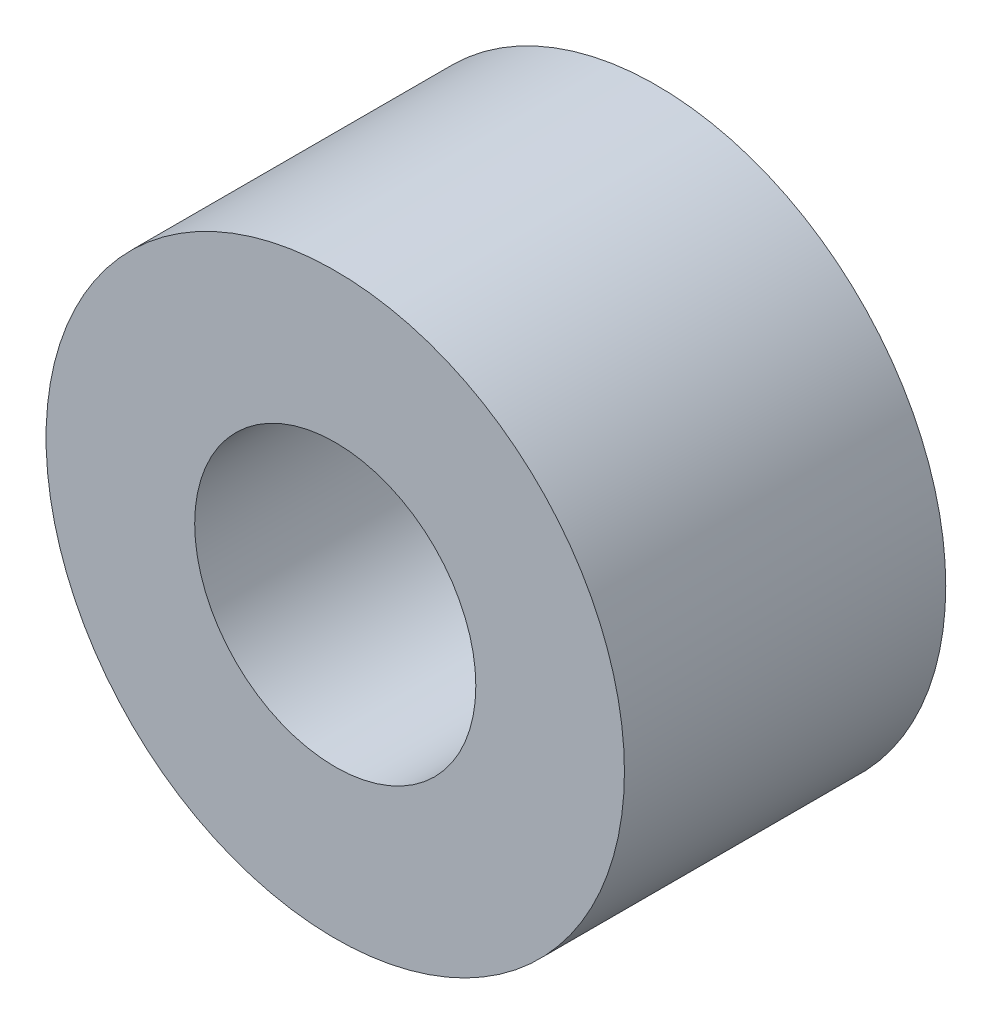
ISO-10303-21;
HEADER;
FILE_DESCRIPTION(('STEP AP214'),'2;1');
FILE_NAME('part.step','',(''),(''),'','','');
FILE_SCHEMA(('AUTOMOTIVE_DESIGN { 1 0 10303 214 1 1 1 1 }'));
ENDSEC;
DATA;
#1=APPLICATION_CONTEXT('core data for automotive mechanical design processes');
#2=APPLICATION_PROTOCOL_DEFINITION('international standard','automotive_design',2000,#1);
#3=PRODUCT_CONTEXT('',#1,'mechanical');
#4=PRODUCT('Part','Part','',(#3));
#5=PRODUCT_RELATED_PRODUCT_CATEGORY('part','',(#4));
#6=PRODUCT_DEFINITION_FORMATION('','',#4);
#7=PRODUCT_DEFINITION_CONTEXT('part definition',#1,'design');
#8=PRODUCT_DEFINITION('design','',#6,#7);
#9=PRODUCT_DEFINITION_SHAPE('','',#8);
#10=(LENGTH_UNIT() NAMED_UNIT(*) SI_UNIT(.MILLI.,.METRE.));
#11=(NAMED_UNIT(*) PLANE_ANGLE_UNIT() SI_UNIT($,.RADIAN.));
#12=(NAMED_UNIT(*) SI_UNIT($,.STERADIAN.) SOLID_ANGLE_UNIT());
#13=UNCERTAINTY_MEASURE_WITH_UNIT(LENGTH_MEASURE(1.E-05),#10,'distance_accuracy_value','');
#14=(GEOMETRIC_REPRESENTATION_CONTEXT(3) GLOBAL_UNCERTAINTY_ASSIGNED_CONTEXT((#13)) GLOBAL_UNIT_ASSIGNED_CONTEXT((#10,
#11,#12)) REPRESENTATION_CONTEXT('',''));
#15=CARTESIAN_POINT('',(0.,0.,0.));
#16=DIRECTION('',(0.,0.,1.));
#17=DIRECTION('',(1.,0.,0.));
#18=AXIS2_PLACEMENT_3D('',#15,#16,#17);
#19=CARTESIAN_POINT('',(0.,0.,20.));
#20=DIRECTION('',(0.,0.,-1.));
#21=DIRECTION('',(-1.,0.,0.));
#22=AXIS2_PLACEMENT_3D('',#19,#20,#21);
#23=CYLINDRICAL_SURFACE('',#22,18.);
#24=CARTESIAN_POINT('',(0.,0.,20.));
#25=DIRECTION('',(0.,0.,1.));
#26=DIRECTION('',(1.,0.,0.));
#27=AXIS2_PLACEMENT_3D('',#24,#25,#26);
#28=CIRCLE('',#27,18.);
#29=CARTESIAN_POINT('',(18.,0.,20.));
#30=VERTEX_POINT('',#29);
#31=EDGE_CURVE('E10',#30,#30,#28,.T.);
#32=ORIENTED_EDGE('',*,*,#31,.F.);
#33=EDGE_LOOP('',(#32));
#34=FACE_BOUND('',#33,.T.);
#35=CARTESIAN_POINT('',(0.,0.,0.));
#36=DIRECTION('',(0.,0.,1.));
#37=DIRECTION('',(1.,0.,0.));
#38=AXIS2_PLACEMENT_3D('',#35,#36,#37);
#39=CIRCLE('',#38,18.);
#40=CARTESIAN_POINT('',(18.,0.,0.));
#41=VERTEX_POINT('',#40);
#42=EDGE_CURVE('E39',#41,#41,#39,.T.);
#43=ORIENTED_EDGE('',*,*,#42,.T.);
#44=EDGE_LOOP('',(#43));
#45=FACE_BOUND('',#44,.T.);
#46=ADVANCED_FACE('F36',(#34,#45),#23,.T.);
#47=CARTESIAN_POINT('',(0.,0.,20.));
#48=DIRECTION('',(0.,0.,1.));
#49=DIRECTION('',(1.,0.,0.));
#50=AXIS2_PLACEMENT_3D('',#47,#48,#49);
#51=PLANE('',#50);
#52=CARTESIAN_POINT('',(0.,0.,20.));
#53=DIRECTION('',(0.,0.,1.));
#54=DIRECTION('',(1.,0.,0.));
#55=AXIS2_PLACEMENT_3D('',#52,#53,#54);
#56=CIRCLE('',#55,8.74999999999999);
#57=CARTESIAN_POINT('',(8.74999999999999,0.,20.));
#58=VERTEX_POINT('',#57);
#59=EDGE_CURVE('E46',#58,#58,#56,.T.);
#60=ORIENTED_EDGE('',*,*,#59,.F.);
#61=EDGE_LOOP('',(#60));
#62=FACE_BOUND('',#61,.T.);
#63=ORIENTED_EDGE('',*,*,#31,.T.);
#64=EDGE_LOOP('',(#63));
#65=FACE_BOUND('',#64,.T.);
#66=ADVANCED_FACE('F59',(#62,#65),#51,.T.);
#67=CARTESIAN_POINT('',(0.,0.,0.));
#68=DIRECTION('',(0.,0.,1.));
#69=DIRECTION('',(1.,0.,0.));
#70=AXIS2_PLACEMENT_3D('',#67,#68,#69);
#71=PLANE('',#70);
#72=CARTESIAN_POINT('',(0.,0.,0.));
#73=DIRECTION('',(0.,0.,-1.));
#74=DIRECTION('',(-1.,0.,0.));
#75=AXIS2_PLACEMENT_3D('',#72,#73,#74);
#76=CIRCLE('',#75,8.75);
#77=CARTESIAN_POINT('',(-8.75,0.,0.));
#78=VERTEX_POINT('',#77);
#79=EDGE_CURVE('E50',#78,#78,#76,.T.);
#80=ORIENTED_EDGE('',*,*,#79,.F.);
#81=EDGE_LOOP('',(#80));
#82=FACE_BOUND('',#81,.T.);
#83=ORIENTED_EDGE('',*,*,#42,.F.);
#84=EDGE_LOOP('',(#83));
#85=FACE_BOUND('',#84,.T.);
#86=ADVANCED_FACE('F56',(#82,#85),#71,.F.);
#87=CARTESIAN_POINT('',(0.,0.,0.));
#88=DIRECTION('',(0.,0.,-1.));
#89=DIRECTION('',(-1.,0.,0.));
#90=AXIS2_PLACEMENT_3D('',#87,#88,#89);
#91=CYLINDRICAL_SURFACE('',#90,8.74999999999999);
#92=ORIENTED_EDGE('',*,*,#59,.T.);
#93=EDGE_LOOP('',(#92));
#94=FACE_BOUND('',#93,.T.);
#95=ORIENTED_EDGE('',*,*,#79,.T.);
#96=EDGE_LOOP('',(#95));
#97=FACE_BOUND('',#96,.T.);
#98=ADVANCED_FACE('F54',(#94,#97),#91,.F.);
#99=CLOSED_SHELL('',(#46,#66,#86,#98));
#100=MANIFOLD_SOLID_BREP('B2',#99);
#101=ADVANCED_BREP_SHAPE_REPRESENTATION('',(#18,#100),#14);
#102=SHAPE_DEFINITION_REPRESENTATION(#9,#101);
ENDSEC;
END-ISO-10303-21;
